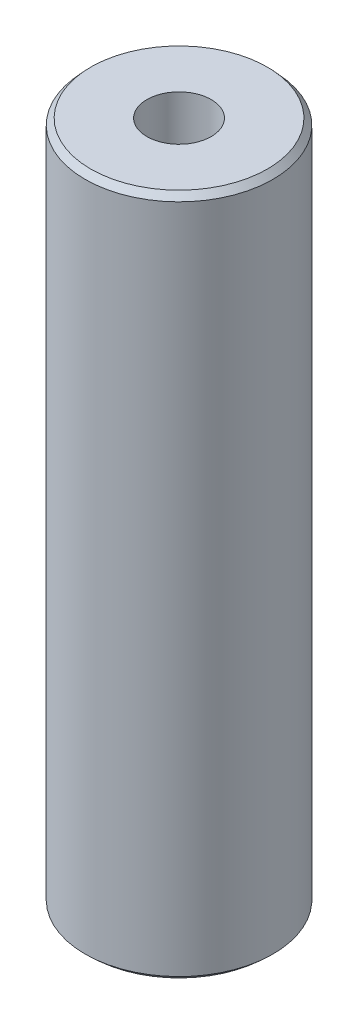
ISO-10303-21;
HEADER;
FILE_DESCRIPTION(('STEP AP214'),'2;1');
FILE_NAME('part.step','',(''),(''),'','','');
FILE_SCHEMA(('AUTOMOTIVE_DESIGN { 1 0 10303 214 1 1 1 1 }'));
ENDSEC;
DATA;
#1=APPLICATION_CONTEXT('core data for automotive mechanical design processes');
#2=APPLICATION_PROTOCOL_DEFINITION('international standard','automotive_design',2000,#1);
#3=PRODUCT_CONTEXT('',#1,'mechanical');
#4=PRODUCT('Part','Part','',(#3));
#5=PRODUCT_RELATED_PRODUCT_CATEGORY('part','',(#4));
#6=PRODUCT_DEFINITION_FORMATION('','',#4);
#7=PRODUCT_DEFINITION_CONTEXT('part definition',#1,'design');
#8=PRODUCT_DEFINITION('design','',#6,#7);
#9=PRODUCT_DEFINITION_SHAPE('','',#8);
#10=(LENGTH_UNIT() NAMED_UNIT(*) SI_UNIT(.MILLI.,.METRE.));
#11=(NAMED_UNIT(*) PLANE_ANGLE_UNIT() SI_UNIT($,.RADIAN.));
#12=(NAMED_UNIT(*) SI_UNIT($,.STERADIAN.) SOLID_ANGLE_UNIT());
#13=UNCERTAINTY_MEASURE_WITH_UNIT(LENGTH_MEASURE(1.E-05),#10,'distance_accuracy_value','');
#14=(GEOMETRIC_REPRESENTATION_CONTEXT(3) GLOBAL_UNCERTAINTY_ASSIGNED_CONTEXT((#13)) GLOBAL_UNIT_ASSIGNED_CONTEXT((#10,
#11,#12)) REPRESENTATION_CONTEXT('',''));
#15=CARTESIAN_POINT('',(0.,0.,0.));
#16=DIRECTION('',(0.,0.,1.));
#17=DIRECTION('',(1.,0.,0.));
#18=AXIS2_PLACEMENT_3D('',#15,#16,#17);
#19=CARTESIAN_POINT('',(0.,327.091430981435,0.));
#20=DIRECTION('',(0.,-1.,0.));
#21=DIRECTION('',(0.,0.,-1.));
#22=AXIS2_PLACEMENT_3D('',#19,#20,#21);
#23=CYLINDRICAL_SURFACE('',#22,45.);
#24=CARTESIAN_POINT('',(0.,324.143725042448,0.));
#25=DIRECTION('',(0.,1.,0.));
#26=DIRECTION('',(0.,0.,1.));
#27=AXIS2_PLACEMENT_3D('',#24,#25,#26);
#28=CIRCLE('',#27,45.);
#29=CARTESIAN_POINT('',(0.,324.143725042448,45.));
#30=VERTEX_POINT('',#29);
#31=EDGE_CURVE('E50',#30,#30,#28,.F.);
#32=ORIENTED_EDGE('',*,*,#31,.T.);
#33=EDGE_LOOP('',(#32));
#34=FACE_BOUND('',#33,.T.);
#35=CARTESIAN_POINT('',(0.,2.67195360370948,0.));
#36=DIRECTION('',(0.,1.,0.));
#37=DIRECTION('',(0.,0.,1.));
#38=AXIS2_PLACEMENT_3D('',#35,#36,#37);
#39=CIRCLE('',#38,45.);
#40=CARTESIAN_POINT('',(0.,2.67195360370948,45.));
#41=VERTEX_POINT('',#40);
#42=EDGE_CURVE('E51',#41,#41,#39,.T.);
#43=ORIENTED_EDGE('',*,*,#42,.T.);
#44=EDGE_LOOP('',(#43));
#45=FACE_BOUND('',#44,.T.);
#46=ADVANCED_FACE('F39',(#34,#45),#23,.T.);
#47=CARTESIAN_POINT('',(0.,327.091430981435,0.));
#48=DIRECTION('',(0.,1.,0.));
#49=DIRECTION('',(0.,0.,1.));
#50=AXIS2_PLACEMENT_3D('',#47,#48,#49);
#51=PLANE('',#50);
#52=CARTESIAN_POINT('',(0.,327.091430981435,0.));
#53=DIRECTION('',(0.,1.,0.));
#54=DIRECTION('',(0.,0.,1.));
#55=AXIS2_PLACEMENT_3D('',#52,#53,#54);
#56=CIRCLE('',#55,42.3280463962906);
#57=CARTESIAN_POINT('',(0.,327.091430981435,42.3280463962906));
#58=VERTEX_POINT('',#57);
#59=EDGE_CURVE('E54',#58,#58,#56,.T.);
#60=ORIENTED_EDGE('',*,*,#59,.T.);
#61=EDGE_LOOP('',(#60));
#62=FACE_BOUND('',#61,.T.);
#63=CARTESIAN_POINT('',(0.,327.091430981435,0.));
#64=DIRECTION('',(0.,1.,0.));
#65=DIRECTION('',(0.,0.,1.));
#66=AXIS2_PLACEMENT_3D('',#63,#64,#65);
#67=CIRCLE('',#66,15.3990818275356);
#68=CARTESIAN_POINT('',(0.,327.091430981435,15.3990818275356));
#69=VERTEX_POINT('',#68);
#70=EDGE_CURVE('E58',#69,#69,#67,.T.);
#71=ORIENTED_EDGE('',*,*,#70,.F.);
#72=EDGE_LOOP('',(#71));
#73=FACE_BOUND('',#72,.T.);
#74=ADVANCED_FACE('F69',(#62,#73),#51,.T.);
#75=CARTESIAN_POINT('',(0.,0.,0.));
#76=DIRECTION('',(0.,1.,0.));
#77=DIRECTION('',(0.,0.,1.));
#78=AXIS2_PLACEMENT_3D('',#75,#76,#77);
#79=PLANE('',#78);
#80=CARTESIAN_POINT('',(0.,0.,0.));
#81=DIRECTION('',(0.,1.,0.));
#82=DIRECTION('',(0.,0.,1.));
#83=AXIS2_PLACEMENT_3D('',#80,#81,#82);
#84=CIRCLE('',#83,42.0522940610125);
#85=CARTESIAN_POINT('',(0.,0.,42.0522940610125));
#86=VERTEX_POINT('',#85);
#87=EDGE_CURVE('E10',#86,#86,#84,.F.);
#88=ORIENTED_EDGE('',*,*,#87,.T.);
#89=EDGE_LOOP('',(#88));
#90=FACE_BOUND('',#89,.T.);
#91=CARTESIAN_POINT('',(0.,0.,0.));
#92=DIRECTION('',(0.,1.,0.));
#93=DIRECTION('',(0.,0.,1.));
#94=AXIS2_PLACEMENT_3D('',#91,#92,#93);
#95=CIRCLE('',#94,15.3990818275356);
#96=CARTESIAN_POINT('',(0.,0.,15.3990818275356));
#97=VERTEX_POINT('',#96);
#98=EDGE_CURVE('E63',#97,#97,#95,.T.);
#99=ORIENTED_EDGE('',*,*,#98,.T.);
#100=EDGE_LOOP('',(#99));
#101=FACE_BOUND('',#100,.T.);
#102=ADVANCED_FACE('F75',(#90,#101),#79,.F.);
#103=CARTESIAN_POINT('',(0.,327.091430981435,0.));
#104=DIRECTION('',(0.,-1.,0.));
#105=DIRECTION('',(0.,0.,-1.));
#106=AXIS2_PLACEMENT_3D('',#103,#104,#105);
#107=CYLINDRICAL_SURFACE('',#106,15.3990818275356);
#108=ORIENTED_EDGE('',*,*,#70,.T.);
#109=EDGE_LOOP('',(#108));
#110=FACE_BOUND('',#109,.T.);
#111=ORIENTED_EDGE('',*,*,#98,.F.);
#112=EDGE_LOOP('',(#111));
#113=FACE_BOUND('',#112,.T.);
#114=ADVANCED_FACE('F70',(#110,#113),#107,.F.);
#115=CARTESIAN_POINT('',(0.,327.091430981435,0.));
#116=DIRECTION('',(0.,-1.,0.));
#117=DIRECTION('',(0.,0.,-1.));
#118=AXIS2_PLACEMENT_3D('',#115,#116,#117);
#119=CONICAL_SURFACE('',#118,42.3280463962906,0.736368264953573);
#120=ORIENTED_EDGE('',*,*,#31,.F.);
#121=EDGE_LOOP('',(#120));
#122=FACE_BOUND('',#121,.T.);
#123=ORIENTED_EDGE('',*,*,#59,.F.);
#124=EDGE_LOOP('',(#123));
#125=FACE_BOUND('',#124,.T.);
#126=ADVANCED_FACE('F81',(#122,#125),#119,.T.);
#127=CARTESIAN_POINT('',(0.,2.67195360370948,0.));
#128=DIRECTION('',(0.,1.,0.));
#129=DIRECTION('',(0.,0.,1.));
#130=AXIS2_PLACEMENT_3D('',#127,#128,#129);
#131=CONICAL_SURFACE('',#130,45.,0.834428061841321);
#132=CARTESIAN_POINT('',(0.,0.,42.0522940610125));
#133=CARTESIAN_POINT('',(0.,0.0278328500386407,42.0829993312103));
#134=CARTESIAN_POINT('',(0.,0.0556657000772807,42.1137046014081));
#135=CARTESIAN_POINT('',(0.,0.111331400154561,42.1751151418037));
#136=CARTESIAN_POINT('',(0.,0.139164250193201,42.2058204120015));
#137=CARTESIAN_POINT('',(0.,0.194829950270482,42.267230952397));
#138=CARTESIAN_POINT('',(0.,0.222662800309123,42.2979362225948));
#139=CARTESIAN_POINT('',(0.,0.278328500386404,42.3593467629904));
#140=CARTESIAN_POINT('',(0.,0.306161350425044,42.3900520331882));
#141=CARTESIAN_POINT('',(0.,0.361827050502324,42.4514625735837));
#142=CARTESIAN_POINT('',(0.,0.389659900540965,42.4821678437815));
#143=CARTESIAN_POINT('',(0.,0.445325600618246,42.5435783841771));
#144=CARTESIAN_POINT('',(0.,0.473158450656886,42.5742836543749));
#145=CARTESIAN_POINT('',(0.,0.528824150734167,42.6356941947705));
#146=CARTESIAN_POINT('',(0.,0.556657000772807,42.6663994649682));
#147=CARTESIAN_POINT('',(0.,0.612322700850088,42.7278100053638));
#148=CARTESIAN_POINT('',(0.,0.640155550888727,42.7585152755616));
#149=CARTESIAN_POINT('',(0.,0.695821250966009,42.8199258159572));
#150=CARTESIAN_POINT('',(0.,0.72365410100465,42.850631086155));
#151=CARTESIAN_POINT('',(0.,0.779319801081931,42.9120416265505));
#152=CARTESIAN_POINT('',(0.,0.80715265112057,42.9427468967483));
#153=CARTESIAN_POINT('',(0.,0.862818351197851,43.0041574371439));
#154=CARTESIAN_POINT('',(0.,0.890651201236491,43.0348627073417));
#155=CARTESIAN_POINT('',(0.,0.946316901313772,43.0962732477373));
#156=CARTESIAN_POINT('',(0.,0.974149751352413,43.126978517935));
#157=CARTESIAN_POINT('',(0.,1.02981545142969,43.1883890583306));
#158=CARTESIAN_POINT('',(0.,1.05764830146833,43.2190943285284));
#159=CARTESIAN_POINT('',(0.,1.11331400154561,43.280504868924));
#160=CARTESIAN_POINT('',(0.,1.14114685158426,43.3112101391218));
#161=CARTESIAN_POINT('',(0.,1.19681255166154,43.3726206795173));
#162=CARTESIAN_POINT('',(0.,1.22464540170018,43.4033259497151));
#163=CARTESIAN_POINT('',(0.,1.28031110177746,43.4647364901107));
#164=CARTESIAN_POINT('',(0.,1.3081439518161,43.4954417603085));
#165=CARTESIAN_POINT('',(0.,1.36380965189338,43.556852300704));
#166=CARTESIAN_POINT('',(0.,1.39164250193202,43.5875575709018));
#167=CARTESIAN_POINT('',(0.,1.4473082020093,43.6489681112974));
#168=CARTESIAN_POINT('',(0.,1.47514105204794,43.6796733814952));
#169=CARTESIAN_POINT('',(0.,1.53080675212522,43.7410839218908));
#170=CARTESIAN_POINT('',(0.,1.55863960216386,43.7717891920886));
#171=CARTESIAN_POINT('',(0.,1.61430530224114,43.8331997324841));
#172=CARTESIAN_POINT('',(0.,1.64213815227978,43.8639050026819));
#173=CARTESIAN_POINT('',(0.,1.69780385235706,43.9253155430775));
#174=CARTESIAN_POINT('',(0.,1.7256367023957,43.9560208132753));
#175=CARTESIAN_POINT('',(0.,1.78130240247298,44.0174313536708));
#176=CARTESIAN_POINT('',(0.,1.80913525251162,44.0481366238686));
#177=CARTESIAN_POINT('',(0.,1.86480095258891,44.1095471642642));
#178=CARTESIAN_POINT('',(0.,1.89263380262755,44.140252434462));
#179=CARTESIAN_POINT('',(0.,1.94829950270483,44.2016629748576));
#180=CARTESIAN_POINT('',(0.,1.97613235274347,44.2323682450553));
#181=CARTESIAN_POINT('',(0.,2.03179805282075,44.2937787854509));
#182=CARTESIAN_POINT('',(0.,2.05963090285939,44.3244840556487));
#183=CARTESIAN_POINT('',(0.,2.11529660293667,44.3858945960443));
#184=CARTESIAN_POINT('',(0.,2.14312945297531,44.4165998662421));
#185=CARTESIAN_POINT('',(0.,2.19879515305259,44.4780104066376));
#186=CARTESIAN_POINT('',(0.,2.22662800309123,44.5087156768354));
#187=CARTESIAN_POINT('',(0.,2.28229370316851,44.570126217231));
#188=CARTESIAN_POINT('',(0.,2.31012655320715,44.6008314874288));
#189=CARTESIAN_POINT('',(0.,2.36579225328443,44.6622420278244));
#190=CARTESIAN_POINT('',(0.,2.39362510332307,44.6929472980221));
#191=CARTESIAN_POINT('',(0.,2.44929080340035,44.7543578384177));
#192=CARTESIAN_POINT('',(0.,2.47712365343899,44.7850631086155));
#193=CARTESIAN_POINT('',(0.,2.53278935351627,44.8464736490111));
#194=CARTESIAN_POINT('',(0.,2.56062220355491,44.8771789192089));
#195=CARTESIAN_POINT('',(0.,2.61628790363219,44.9385894596044));
#196=CARTESIAN_POINT('',(0.,2.64412075367084,44.9692947298022));
#197=CARTESIAN_POINT('',(0.,2.67195360370948,45.));
#198=B_SPLINE_CURVE_WITH_KNOTS('',3,(#132,#133,#134,#135,#136,#137,#138,#139,#140,#141,#142,
#143,#144,#145,#146,#147,#148,#149,#150,#151,#152,#153,#154,#155,#156,#157,#158,#159,#160,#161,
#162,#163,#164,#165,#166,#167,#168,#169,#170,#171,#172,#173,#174,#175,#176,#177,#178,#179,#180,
#181,#182,#183,#184,#185,#186,#187,#188,#189,#190,#191,#192,#193,#194,#195,#196,#197),
.UNSPECIFIED.,.F.,.F.,(4,2,2,2,2,2,2,2,2,2,2,2,2,2,2,2,2,2,2,2,2,2,2,2,2,2,2,2,2,2,2,2,4),(0.,
0.124327512774658,0.248655025549316,0.372982538323969,0.497310051098627,0.621637563873285,
0.745965076647943,0.870292589422601,0.994620102197259,1.11894761497191,1.24327512774657,
1.36760264052123,1.49193015329589,1.61625766607054,1.7405851788452,1.86491269161986,
1.98924020439451,2.11356771716917,2.23789522994383,2.36222274271849,2.48655025549315,
2.6108777682678,2.73520528104246,2.85953279381712,2.98386030659177,3.10818781936643,
3.23251533214109,3.35684284491575,3.48117035769041,3.60549787046506,3.72982538323972,
3.85415289601438,3.97848040878904),.UNSPECIFIED.);
#199=EDGE_CURVE('BSEAM45',#86,#41,#198,.T.);
#200=ORIENTED_EDGE('',*,*,#87,.F.);
#201=ORIENTED_EDGE('',*,*,#42,.F.);
#202=ORIENTED_EDGE('',*,*,#199,.T.);
#203=ORIENTED_EDGE('',*,*,#199,.F.);
#204=EDGE_LOOP('',(#200,#202,#201,#203));
#205=FACE_BOUND('',#204,.T.);
#206=ADVANCED_FACE('F45',(#205),#131,.T.);
#207=CLOSED_SHELL('',(#46,#74,#102,#114,#126,#206));
#208=MANIFOLD_SOLID_BREP('B2',#207);
#209=ADVANCED_BREP_SHAPE_REPRESENTATION('',(#18,#208),#14);
#210=SHAPE_DEFINITION_REPRESENTATION(#9,#209);
ENDSEC;
END-ISO-10303-21;
